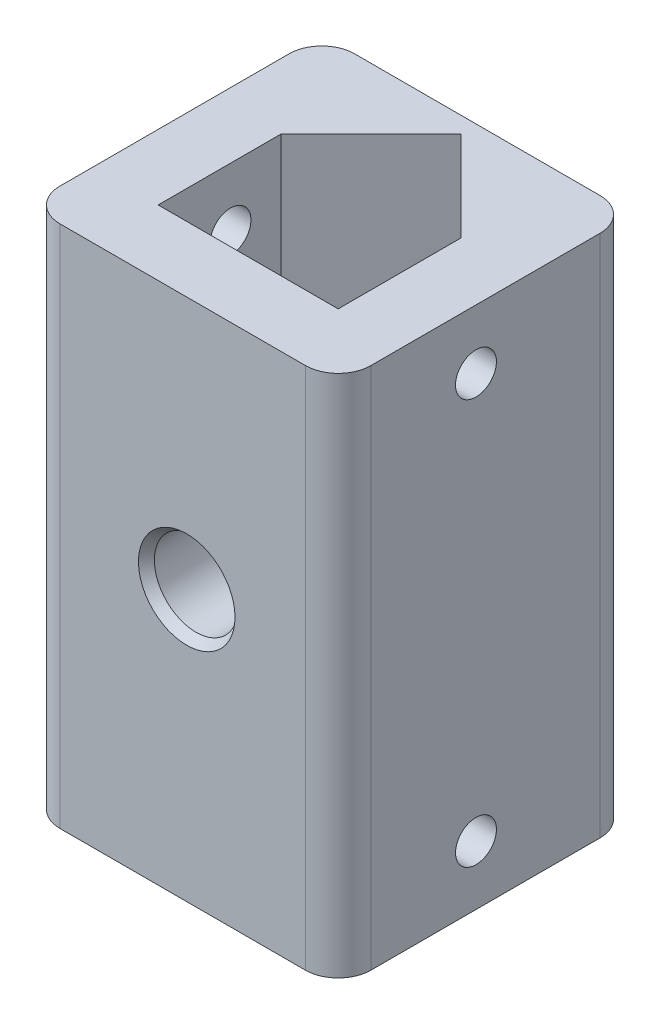
ISO-10303-21;
HEADER;
FILE_DESCRIPTION(('STEP AP214'),'2;1');
FILE_NAME('part.step','',(''),(''),'','','');
FILE_SCHEMA(('AUTOMOTIVE_DESIGN { 1 0 10303 214 1 1 1 1 }'));
ENDSEC;
DATA;
#1=APPLICATION_CONTEXT('core data for automotive mechanical design processes');
#2=APPLICATION_PROTOCOL_DEFINITION('international standard','automotive_design',2000,#1);
#3=PRODUCT_CONTEXT('',#1,'mechanical');
#4=PRODUCT('Part','Part','',(#3));
#5=PRODUCT_RELATED_PRODUCT_CATEGORY('part','',(#4));
#6=PRODUCT_DEFINITION_FORMATION('','',#4);
#7=PRODUCT_DEFINITION_CONTEXT('part definition',#1,'design');
#8=PRODUCT_DEFINITION('design','',#6,#7);
#9=PRODUCT_DEFINITION_SHAPE('','',#8);
#10=(LENGTH_UNIT() NAMED_UNIT(*) SI_UNIT(.MILLI.,.METRE.));
#11=(NAMED_UNIT(*) PLANE_ANGLE_UNIT() SI_UNIT($,.RADIAN.));
#12=(NAMED_UNIT(*) SI_UNIT($,.STERADIAN.) SOLID_ANGLE_UNIT());
#13=UNCERTAINTY_MEASURE_WITH_UNIT(LENGTH_MEASURE(1.E-05),#10,'distance_accuracy_value','');
#14=(GEOMETRIC_REPRESENTATION_CONTEXT(3) GLOBAL_UNCERTAINTY_ASSIGNED_CONTEXT((#13)) GLOBAL_UNIT_ASSIGNED_CONTEXT((#10,
#11,#12)) REPRESENTATION_CONTEXT('',''));
#15=CARTESIAN_POINT('',(0.,0.,0.));
#16=DIRECTION('',(0.,0.,1.));
#17=DIRECTION('',(1.,0.,0.));
#18=AXIS2_PLACEMENT_3D('',#15,#16,#17);
#19=CARTESIAN_POINT('',(0.,32.,0.));
#20=DIRECTION('',(0.,-1.,0.));
#21=DIRECTION('',(0.,0.,-1.));
#22=AXIS2_PLACEMENT_3D('',#19,#20,#21);
#23=PLANE('',#22);
#24=DIRECTION('',(0.,0.,-1.));
#25=VECTOR('',#24,1.);
#26=CARTESIAN_POINT('',(19.,32.,0.));
#27=LINE('',#26,#25);
#28=CARTESIAN_POINT('',(19.,32.,-2.));
#29=VERTEX_POINT('',#28);
#30=CARTESIAN_POINT('',(19.,32.,-16.));
#31=VERTEX_POINT('',#30);
#32=EDGE_CURVE('E231',#29,#31,#27,.T.);
#33=ORIENTED_EDGE('',*,*,#32,.T.);
#34=CARTESIAN_POINT('',(17.,32.,-16.));
#35=DIRECTION('',(0.,-1.,0.));
#36=DIRECTION('',(0.,0.,-1.));
#37=AXIS2_PLACEMENT_3D('',#34,#35,#36);
#38=CIRCLE('',#37,2.);
#39=CARTESIAN_POINT('',(17.,32.,-18.));
#40=VERTEX_POINT('',#39);
#41=EDGE_CURVE('E295',#31,#40,#38,.F.);
#42=ORIENTED_EDGE('',*,*,#41,.T.);
#43=DIRECTION('',(-1.,0.,0.));
#44=VECTOR('',#43,1.);
#45=CARTESIAN_POINT('',(0.,32.,-18.));
#46=LINE('',#45,#44);
#47=CARTESIAN_POINT('',(2.,32.,-18.));
#48=VERTEX_POINT('',#47);
#49=EDGE_CURVE('E235',#40,#48,#46,.T.);
#50=ORIENTED_EDGE('',*,*,#49,.T.);
#51=CARTESIAN_POINT('',(2.,32.,-16.));
#52=DIRECTION('',(0.,-1.,0.));
#53=DIRECTION('',(0.,0.,-1.));
#54=AXIS2_PLACEMENT_3D('',#51,#52,#53);
#55=CIRCLE('',#54,2.);
#56=CARTESIAN_POINT('',(0.,32.,-16.));
#57=VERTEX_POINT('',#56);
#58=EDGE_CURVE('E289',#48,#57,#55,.F.);
#59=ORIENTED_EDGE('',*,*,#58,.T.);
#60=DIRECTION('',(0.,0.,1.));
#61=VECTOR('',#60,1.);
#62=CARTESIAN_POINT('',(0.,32.,0.));
#63=LINE('',#62,#61);
#64=CARTESIAN_POINT('',(0.,32.,-2.));
#65=VERTEX_POINT('',#64);
#66=EDGE_CURVE('E225',#57,#65,#63,.T.);
#67=ORIENTED_EDGE('',*,*,#66,.T.);
#68=CARTESIAN_POINT('',(2.,32.,-2.));
#69=DIRECTION('',(0.,-1.,0.));
#70=DIRECTION('',(0.,0.,-1.));
#71=AXIS2_PLACEMENT_3D('',#68,#69,#70);
#72=CIRCLE('',#71,2.);
#73=CARTESIAN_POINT('',(2.,32.,0.));
#74=VERTEX_POINT('',#73);
#75=EDGE_CURVE('E67',#65,#74,#72,.F.);
#76=ORIENTED_EDGE('',*,*,#75,.T.);
#77=DIRECTION('',(1.,0.,0.));
#78=VECTOR('',#77,1.);
#79=CARTESIAN_POINT('',(0.,32.,0.));
#80=LINE('',#79,#78);
#81=CARTESIAN_POINT('',(17.,32.,0.));
#82=VERTEX_POINT('',#81);
#83=EDGE_CURVE('E227',#74,#82,#80,.T.);
#84=ORIENTED_EDGE('',*,*,#83,.T.);
#85=CARTESIAN_POINT('',(17.,32.,-2.));
#86=DIRECTION('',(0.,-1.,0.));
#87=DIRECTION('',(0.,0.,-1.));
#88=AXIS2_PLACEMENT_3D('',#85,#86,#87);
#89=CIRCLE('',#88,2.);
#90=EDGE_CURVE('E292',#82,#29,#89,.F.);
#91=ORIENTED_EDGE('',*,*,#90,.T.);
#92=EDGE_LOOP('',(#33,#42,#50,#59,#67,#76,#84,#91));
#93=FACE_BOUND('',#92,.T.);
#94=DIRECTION('',(0.,0.,1.));
#95=VECTOR('',#94,1.);
#96=CARTESIAN_POINT('',(4.,32.,-11.5));
#97=LINE('',#96,#95);
#98=CARTESIAN_POINT('',(4.,32.,-11.5));
#99=VERTEX_POINT('',#98);
#100=CARTESIAN_POINT('',(4.,32.,-4.));
#101=VERTEX_POINT('',#100);
#102=EDGE_CURVE('E159',#99,#101,#97,.T.);
#103=ORIENTED_EDGE('',*,*,#102,.F.);
#104=DIRECTION('',(-0.707106781186546,0.,0.707106781186549));
#105=VECTOR('',#104,1.);
#106=CARTESIAN_POINT('',(9.5,32.,-17.));
#107=LINE('',#106,#105);
#108=CARTESIAN_POINT('',(9.5,32.,-17.));
#109=VERTEX_POINT('',#108);
#110=EDGE_CURVE('E196',#109,#99,#107,.T.);
#111=ORIENTED_EDGE('',*,*,#110,.F.);
#112=DIRECTION('',(-0.707106781186546,0.,-0.707106781186549));
#113=VECTOR('',#112,1.);
#114=CARTESIAN_POINT('',(15.,32.,-11.5));
#115=LINE('',#114,#113);
#116=CARTESIAN_POINT('',(15.,32.,-11.5));
#117=VERTEX_POINT('',#116);
#118=EDGE_CURVE('E189',#117,#109,#115,.T.);
#119=ORIENTED_EDGE('',*,*,#118,.F.);
#120=DIRECTION('',(0.,0.,-1.));
#121=VECTOR('',#120,1.);
#122=CARTESIAN_POINT('',(15.,32.,-4.));
#123=LINE('',#122,#121);
#124=CARTESIAN_POINT('',(15.,32.,-4.));
#125=VERTEX_POINT('',#124);
#126=EDGE_CURVE('E184',#125,#117,#123,.T.);
#127=ORIENTED_EDGE('',*,*,#126,.F.);
#128=DIRECTION('',(1.,0.,0.));
#129=VECTOR('',#128,1.);
#130=CARTESIAN_POINT('',(4.,32.,-4.));
#131=LINE('',#130,#129);
#132=EDGE_CURVE('E170',#101,#125,#131,.T.);
#133=ORIENTED_EDGE('',*,*,#132,.F.);
#134=EDGE_LOOP('',(#103,#111,#119,#127,#133));
#135=FACE_BOUND('',#134,.T.);
#136=ADVANCED_FACE('F38',(#93,#135),#23,.F.);
#137=CARTESIAN_POINT('',(0.,0.,0.));
#138=DIRECTION('',(0.,-1.,0.));
#139=DIRECTION('',(0.,0.,-1.));
#140=AXIS2_PLACEMENT_3D('',#137,#138,#139);
#141=PLANE('',#140);
#142=DIRECTION('',(-1.,0.,0.));
#143=VECTOR('',#142,1.);
#144=CARTESIAN_POINT('',(0.,0.,-18.));
#145=LINE('',#144,#143);
#146=CARTESIAN_POINT('',(17.,0.,-18.));
#147=VERTEX_POINT('',#146);
#148=CARTESIAN_POINT('',(2.,0.,-18.));
#149=VERTEX_POINT('',#148);
#150=EDGE_CURVE('E228',#147,#149,#145,.T.);
#151=ORIENTED_EDGE('',*,*,#150,.F.);
#152=CARTESIAN_POINT('',(17.,0.,-16.));
#153=DIRECTION('',(0.,-1.,0.));
#154=DIRECTION('',(0.,0.,-1.));
#155=AXIS2_PLACEMENT_3D('',#152,#153,#154);
#156=CIRCLE('',#155,2.);
#157=CARTESIAN_POINT('',(19.,0.,-16.));
#158=VERTEX_POINT('',#157);
#159=EDGE_CURVE('E277',#147,#158,#156,.T.);
#160=ORIENTED_EDGE('',*,*,#159,.T.);
#161=DIRECTION('',(0.,0.,-1.));
#162=VECTOR('',#161,1.);
#163=CARTESIAN_POINT('',(19.,0.,0.));
#164=LINE('',#163,#162);
#165=CARTESIAN_POINT('',(19.,0.,-2.));
#166=VERTEX_POINT('',#165);
#167=EDGE_CURVE('E246',#166,#158,#164,.T.);
#168=ORIENTED_EDGE('',*,*,#167,.F.);
#169=CARTESIAN_POINT('',(17.,0.,-2.));
#170=DIRECTION('',(0.,-1.,0.));
#171=DIRECTION('',(0.,0.,-1.));
#172=AXIS2_PLACEMENT_3D('',#169,#170,#171);
#173=CIRCLE('',#172,2.);
#174=CARTESIAN_POINT('',(17.,0.,0.));
#175=VERTEX_POINT('',#174);
#176=EDGE_CURVE('E275',#166,#175,#173,.T.);
#177=ORIENTED_EDGE('',*,*,#176,.T.);
#178=DIRECTION('',(1.,0.,0.));
#179=VECTOR('',#178,1.);
#180=CARTESIAN_POINT('',(0.,0.,0.));
#181=LINE('',#180,#179);
#182=CARTESIAN_POINT('',(2.,0.,0.));
#183=VERTEX_POINT('',#182);
#184=EDGE_CURVE('E243',#183,#175,#181,.T.);
#185=ORIENTED_EDGE('',*,*,#184,.F.);
#186=CARTESIAN_POINT('',(2.,0.,-2.));
#187=DIRECTION('',(0.,-1.,0.));
#188=DIRECTION('',(0.,0.,-1.));
#189=AXIS2_PLACEMENT_3D('',#186,#187,#188);
#190=CIRCLE('',#189,2.);
#191=CARTESIAN_POINT('',(0.,0.,-2.));
#192=VERTEX_POINT('',#191);
#193=EDGE_CURVE('E269',#183,#192,#190,.T.);
#194=ORIENTED_EDGE('',*,*,#193,.T.);
#195=DIRECTION('',(0.,0.,1.));
#196=VECTOR('',#195,1.);
#197=CARTESIAN_POINT('',(0.,0.,0.));
#198=LINE('',#197,#196);
#199=CARTESIAN_POINT('',(0.,0.,-16.));
#200=VERTEX_POINT('',#199);
#201=EDGE_CURVE('E179',#200,#192,#198,.T.);
#202=ORIENTED_EDGE('',*,*,#201,.F.);
#203=CARTESIAN_POINT('',(2.,0.,-16.));
#204=DIRECTION('',(0.,-1.,0.));
#205=DIRECTION('',(0.,0.,-1.));
#206=AXIS2_PLACEMENT_3D('',#203,#204,#205);
#207=CIRCLE('',#206,2.);
#208=EDGE_CURVE('E272',#200,#149,#207,.T.);
#209=ORIENTED_EDGE('',*,*,#208,.T.);
#210=EDGE_LOOP('',(#151,#160,#168,#177,#185,#194,#202,#209));
#211=FACE_BOUND('',#210,.T.);
#212=DIRECTION('',(-0.707106781186546,0.,0.707106781186549));
#213=VECTOR('',#212,1.);
#214=CARTESIAN_POINT('',(9.5,0.,-17.));
#215=LINE('',#214,#213);
#216=CARTESIAN_POINT('',(9.5,0.,-17.));
#217=VERTEX_POINT('',#216);
#218=CARTESIAN_POINT('',(4.,0.,-11.5));
#219=VERTEX_POINT('',#218);
#220=EDGE_CURVE('E171',#217,#219,#215,.T.);
#221=ORIENTED_EDGE('',*,*,#220,.T.);
#222=DIRECTION('',(0.,0.,1.));
#223=VECTOR('',#222,1.);
#224=CARTESIAN_POINT('',(4.,0.,-11.5));
#225=LINE('',#224,#223);
#226=CARTESIAN_POINT('',(4.,0.,-4.));
#227=VERTEX_POINT('',#226);
#228=EDGE_CURVE('E199',#219,#227,#225,.T.);
#229=ORIENTED_EDGE('',*,*,#228,.T.);
#230=DIRECTION('',(1.,0.,0.));
#231=VECTOR('',#230,1.);
#232=CARTESIAN_POINT('',(4.,0.,-4.));
#233=LINE('',#232,#231);
#234=CARTESIAN_POINT('',(15.,0.,-4.));
#235=VERTEX_POINT('',#234);
#236=EDGE_CURVE('E177',#227,#235,#233,.T.);
#237=ORIENTED_EDGE('',*,*,#236,.T.);
#238=DIRECTION('',(0.,0.,-1.));
#239=VECTOR('',#238,1.);
#240=CARTESIAN_POINT('',(15.,0.,-4.));
#241=LINE('',#240,#239);
#242=CARTESIAN_POINT('',(15.,0.,-11.5));
#243=VERTEX_POINT('',#242);
#244=EDGE_CURVE('E205',#235,#243,#241,.T.);
#245=ORIENTED_EDGE('',*,*,#244,.T.);
#246=DIRECTION('',(-0.707106781186546,0.,-0.707106781186549));
#247=VECTOR('',#246,1.);
#248=CARTESIAN_POINT('',(15.,0.,-11.5));
#249=LINE('',#248,#247);
#250=EDGE_CURVE('E208',#243,#217,#249,.T.);
#251=ORIENTED_EDGE('',*,*,#250,.T.);
#252=EDGE_LOOP('',(#221,#229,#237,#245,#251));
#253=FACE_BOUND('',#252,.T.);
#254=ADVANCED_FACE('F317',(#211,#253),#141,.T.);
#255=CARTESIAN_POINT('',(0.,32.,0.));
#256=DIRECTION('',(1.,0.,0.));
#257=DIRECTION('',(0.,0.,-1.));
#258=AXIS2_PLACEMENT_3D('',#255,#256,#257);
#259=PLANE('',#258);
#260=CARTESIAN_POINT('',(0.,28.3749999996663,-8.41922621917511));
#261=DIRECTION('',(1.,0.,0.));
#262=DIRECTION('',(0.,0.,-1.));
#263=AXIS2_PLACEMENT_3D('',#260,#261,#262);
#264=CIRCLE('',#263,1.24999999999999);
#265=CARTESIAN_POINT('',(0.,28.3749999996663,-9.6692262191751));
#266=VERTEX_POINT('',#265);
#267=EDGE_CURVE('E262',#266,#266,#264,.T.);
#268=ORIENTED_EDGE('',*,*,#267,.T.);
#269=EDGE_LOOP('',(#268));
#270=FACE_BOUND('',#269,.T.);
#271=CARTESIAN_POINT('',(0.,3.62499999999998,-8.41922621917511));
#272=DIRECTION('',(1.,0.,0.));
#273=DIRECTION('',(0.,0.,-1.));
#274=AXIS2_PLACEMENT_3D('',#271,#272,#273);
#275=CIRCLE('',#274,1.25);
#276=CARTESIAN_POINT('',(0.,3.62499999999998,-9.66922621917511));
#277=VERTEX_POINT('',#276);
#278=EDGE_CURVE('E256',#277,#277,#275,.T.);
#279=ORIENTED_EDGE('',*,*,#278,.T.);
#280=EDGE_LOOP('',(#279));
#281=FACE_BOUND('',#280,.T.);
#282=ORIENTED_EDGE('',*,*,#66,.F.);
#283=DIRECTION('',(0.,-1.,0.));
#284=VECTOR('',#283,1.);
#285=CARTESIAN_POINT('',(0.,32.,-16.));
#286=LINE('',#285,#284);
#287=EDGE_CURVE('E11',#57,#200,#286,.T.);
#288=ORIENTED_EDGE('',*,*,#287,.T.);
#289=ORIENTED_EDGE('',*,*,#201,.T.);
#290=DIRECTION('',(0.,-1.,0.));
#291=VECTOR('',#290,1.);
#292=CARTESIAN_POINT('',(0.,32.,-2.));
#293=LINE('',#292,#291);
#294=EDGE_CURVE('E47',#192,#65,#293,.F.);
#295=ORIENTED_EDGE('',*,*,#294,.T.);
#296=EDGE_LOOP('',(#282,#288,#289,#295));
#297=FACE_BOUND('',#296,.T.);
#298=ADVANCED_FACE('F307',(#270,#281,#297),#259,.F.);
#299=CARTESIAN_POINT('',(0.,32.,0.));
#300=DIRECTION('',(0.,0.,-1.));
#301=DIRECTION('',(-1.,0.,0.));
#302=AXIS2_PLACEMENT_3D('',#299,#300,#301);
#303=PLANE('',#302);
#304=CARTESIAN_POINT('',(9.74439764527801,16.5210513003871,0.));
#305=DIRECTION('',(0.,0.,1.));
#306=DIRECTION('',(1.,0.,0.));
#307=AXIS2_PLACEMENT_3D('',#304,#305,#306);
#308=CIRCLE('',#307,2.95);
#309=CARTESIAN_POINT('',(12.694397645278,16.5210513003871,0.));
#310=VERTEX_POINT('',#309);
#311=EDGE_CURVE('E417',#310,#310,#308,.T.);
#312=ORIENTED_EDGE('',*,*,#311,.F.);
#313=EDGE_LOOP('',(#312));
#314=FACE_BOUND('',#313,.T.);
#315=ORIENTED_EDGE('',*,*,#184,.T.);
#316=DIRECTION('',(0.,-1.,0.));
#317=VECTOR('',#316,1.);
#318=CARTESIAN_POINT('',(17.,32.,0.));
#319=LINE('',#318,#317);
#320=EDGE_CURVE('E57',#175,#82,#319,.F.);
#321=ORIENTED_EDGE('',*,*,#320,.T.);
#322=ORIENTED_EDGE('',*,*,#83,.F.);
#323=DIRECTION('',(0.,-1.,0.));
#324=VECTOR('',#323,1.);
#325=CARTESIAN_POINT('',(2.,32.,0.));
#326=LINE('',#325,#324);
#327=EDGE_CURVE('E298',#74,#183,#326,.T.);
#328=ORIENTED_EDGE('',*,*,#327,.T.);
#329=EDGE_LOOP('',(#315,#321,#322,#328));
#330=FACE_BOUND('',#329,.T.);
#331=ADVANCED_FACE('F314',(#314,#330),#303,.F.);
#332=CARTESIAN_POINT('',(19.,32.,0.));
#333=DIRECTION('',(-1.,0.,0.));
#334=DIRECTION('',(0.,0.,1.));
#335=AXIS2_PLACEMENT_3D('',#332,#333,#334);
#336=PLANE('',#335);
#337=CARTESIAN_POINT('',(19.,28.3749999996663,-8.41922621917511));
#338=DIRECTION('',(1.,0.,0.));
#339=DIRECTION('',(0.,0.,-1.));
#340=AXIS2_PLACEMENT_3D('',#337,#338,#339);
#341=CIRCLE('',#340,1.25);
#342=CARTESIAN_POINT('',(19.,28.3749999996663,-9.66922621917511));
#343=VERTEX_POINT('',#342);
#344=EDGE_CURVE('E409',#343,#343,#341,.T.);
#345=ORIENTED_EDGE('',*,*,#344,.F.);
#346=EDGE_LOOP('',(#345));
#347=FACE_BOUND('',#346,.T.);
#348=CARTESIAN_POINT('',(19.,3.62499999999998,-8.41922621917511));
#349=DIRECTION('',(1.,0.,0.));
#350=DIRECTION('',(0.,0.,-1.));
#351=AXIS2_PLACEMENT_3D('',#348,#349,#350);
#352=CIRCLE('',#351,1.25);
#353=CARTESIAN_POINT('',(19.,3.62499999999998,-9.66922621917511));
#354=VERTEX_POINT('',#353);
#355=EDGE_CURVE('E426',#354,#354,#352,.T.);
#356=ORIENTED_EDGE('',*,*,#355,.F.);
#357=EDGE_LOOP('',(#356));
#358=FACE_BOUND('',#357,.T.);
#359=ORIENTED_EDGE('',*,*,#167,.T.);
#360=DIRECTION('',(0.,-1.,0.));
#361=VECTOR('',#360,1.);
#362=CARTESIAN_POINT('',(19.,32.,-16.));
#363=LINE('',#362,#361);
#364=EDGE_CURVE('E284',#158,#31,#363,.F.);
#365=ORIENTED_EDGE('',*,*,#364,.T.);
#366=ORIENTED_EDGE('',*,*,#32,.F.);
#367=DIRECTION('',(0.,-1.,0.));
#368=VECTOR('',#367,1.);
#369=CARTESIAN_POINT('',(19.,32.,-2.));
#370=LINE('',#369,#368);
#371=EDGE_CURVE('E280',#29,#166,#370,.T.);
#372=ORIENTED_EDGE('',*,*,#371,.T.);
#373=EDGE_LOOP('',(#359,#365,#366,#372));
#374=FACE_BOUND('',#373,.T.);
#375=ADVANCED_FACE('F326',(#347,#358,#374),#336,.F.);
#376=CARTESIAN_POINT('',(0.,32.,-18.));
#377=DIRECTION('',(0.,0.,1.));
#378=DIRECTION('',(1.,0.,0.));
#379=AXIS2_PLACEMENT_3D('',#376,#377,#378);
#380=PLANE('',#379);
#381=ORIENTED_EDGE('',*,*,#49,.F.);
#382=DIRECTION('',(0.,-1.,0.));
#383=VECTOR('',#382,1.);
#384=CARTESIAN_POINT('',(17.,32.,-18.));
#385=LINE('',#384,#383);
#386=EDGE_CURVE('E265',#40,#147,#385,.T.);
#387=ORIENTED_EDGE('',*,*,#386,.T.);
#388=ORIENTED_EDGE('',*,*,#150,.T.);
#389=DIRECTION('',(0.,-1.,0.));
#390=VECTOR('',#389,1.);
#391=CARTESIAN_POINT('',(2.,32.,-18.));
#392=LINE('',#391,#390);
#393=EDGE_CURVE('E239',#149,#48,#392,.F.);
#394=ORIENTED_EDGE('',*,*,#393,.T.);
#395=EDGE_LOOP('',(#381,#387,#388,#394));
#396=FACE_BOUND('',#395,.T.);
#397=ADVANCED_FACE('F334',(#396),#380,.F.);
#398=CARTESIAN_POINT('',(4.,32.,-11.5));
#399=DIRECTION('',(1.,0.,0.));
#400=DIRECTION('',(0.,0.,-1.));
#401=AXIS2_PLACEMENT_3D('',#398,#399,#400);
#402=PLANE('',#401);
#403=CARTESIAN_POINT('',(4.,28.3749999996663,-8.41922621917511));
#404=DIRECTION('',(1.,0.,0.));
#405=DIRECTION('',(0.,0.,-1.));
#406=AXIS2_PLACEMENT_3D('',#403,#404,#405);
#407=CIRCLE('',#406,1.25);
#408=CARTESIAN_POINT('',(4.,28.3749999996663,-9.66922621917511));
#409=VERTEX_POINT('',#408);
#410=EDGE_CURVE('E261',#409,#409,#407,.T.);
#411=ORIENTED_EDGE('',*,*,#410,.F.);
#412=EDGE_LOOP('',(#411));
#413=FACE_BOUND('',#412,.T.);
#414=CARTESIAN_POINT('',(4.,3.62499999999998,-8.41922621917511));
#415=DIRECTION('',(1.,0.,0.));
#416=DIRECTION('',(0.,0.,-1.));
#417=AXIS2_PLACEMENT_3D('',#414,#415,#416);
#418=CIRCLE('',#417,1.25);
#419=CARTESIAN_POINT('',(4.,3.62499999999998,-9.66922621917511));
#420=VERTEX_POINT('',#419);
#421=EDGE_CURVE('E202',#420,#420,#418,.T.);
#422=ORIENTED_EDGE('',*,*,#421,.F.);
#423=EDGE_LOOP('',(#422));
#424=FACE_BOUND('',#423,.T.);
#425=ORIENTED_EDGE('',*,*,#228,.F.);
#426=DIRECTION('',(0.,-1.,0.));
#427=VECTOR('',#426,1.);
#428=CARTESIAN_POINT('',(4.,32.,-11.5));
#429=LINE('',#428,#427);
#430=EDGE_CURVE('E165',#99,#219,#429,.T.);
#431=ORIENTED_EDGE('',*,*,#430,.F.);
#432=ORIENTED_EDGE('',*,*,#102,.T.);
#433=DIRECTION('',(0.,-1.,0.));
#434=VECTOR('',#433,1.);
#435=CARTESIAN_POINT('',(4.,32.,-4.));
#436=LINE('',#435,#434);
#437=EDGE_CURVE('E162',#101,#227,#436,.T.);
#438=ORIENTED_EDGE('',*,*,#437,.T.);
#439=EDGE_LOOP('',(#425,#431,#432,#438));
#440=FACE_BOUND('',#439,.T.);
#441=ADVANCED_FACE('F161',(#413,#424,#440),#402,.T.);
#442=CARTESIAN_POINT('',(4.,32.,-4.));
#443=DIRECTION('',(0.,0.,-1.));
#444=DIRECTION('',(-1.,0.,0.));
#445=AXIS2_PLACEMENT_3D('',#442,#443,#444);
#446=PLANE('',#445);
#447=CARTESIAN_POINT('',(9.74439764527801,16.5210513003871,-4.));
#448=DIRECTION('',(0.,0.,-1.));
#449=DIRECTION('',(-1.,0.,0.));
#450=AXIS2_PLACEMENT_3D('',#447,#448,#449);
#451=CIRCLE('',#450,2.55);
#452=CARTESIAN_POINT('',(7.19439764527802,16.5210513003871,-4.));
#453=VERTEX_POINT('',#452);
#454=EDGE_CURVE('E406',#453,#453,#451,.T.);
#455=ORIENTED_EDGE('',*,*,#454,.F.);
#456=EDGE_LOOP('',(#455));
#457=FACE_BOUND('',#456,.T.);
#458=ORIENTED_EDGE('',*,*,#236,.F.);
#459=ORIENTED_EDGE('',*,*,#437,.F.);
#460=ORIENTED_EDGE('',*,*,#132,.T.);
#461=DIRECTION('',(0.,-1.,0.));
#462=VECTOR('',#461,1.);
#463=CARTESIAN_POINT('',(15.,32.,-4.));
#464=LINE('',#463,#462);
#465=EDGE_CURVE('E180',#125,#235,#464,.T.);
#466=ORIENTED_EDGE('',*,*,#465,.T.);
#467=EDGE_LOOP('',(#458,#459,#460,#466));
#468=FACE_BOUND('',#467,.T.);
#469=ADVANCED_FACE('F174',(#457,#468),#446,.T.);
#470=CARTESIAN_POINT('',(15.,32.,-4.));
#471=DIRECTION('',(-1.,0.,0.));
#472=DIRECTION('',(0.,0.,1.));
#473=AXIS2_PLACEMENT_3D('',#470,#471,#472);
#474=PLANE('',#473);
#475=CARTESIAN_POINT('',(15.,28.3749999996663,-8.41922621917511));
#476=DIRECTION('',(-1.,0.,0.));
#477=DIRECTION('',(0.,0.,1.));
#478=AXIS2_PLACEMENT_3D('',#475,#476,#477);
#479=CIRCLE('',#478,1.25);
#480=CARTESIAN_POINT('',(15.,28.3749999996663,-7.16922621917511));
#481=VERTEX_POINT('',#480);
#482=EDGE_CURVE('E257',#481,#481,#479,.T.);
#483=ORIENTED_EDGE('',*,*,#482,.F.);
#484=EDGE_LOOP('',(#483));
#485=FACE_BOUND('',#484,.T.);
#486=CARTESIAN_POINT('',(15.,3.62499999999998,-8.41922621917511));
#487=DIRECTION('',(-1.,0.,0.));
#488=DIRECTION('',(0.,0.,1.));
#489=AXIS2_PLACEMENT_3D('',#486,#487,#488);
#490=CIRCLE('',#489,1.25);
#491=CARTESIAN_POINT('',(15.,3.62499999999998,-7.16922621917512));
#492=VERTEX_POINT('',#491);
#493=EDGE_CURVE('E253',#492,#492,#490,.T.);
#494=ORIENTED_EDGE('',*,*,#493,.F.);
#495=EDGE_LOOP('',(#494));
#496=FACE_BOUND('',#495,.T.);
#497=ORIENTED_EDGE('',*,*,#244,.F.);
#498=ORIENTED_EDGE('',*,*,#465,.F.);
#499=ORIENTED_EDGE('',*,*,#126,.T.);
#500=DIRECTION('',(0.,-1.,0.));
#501=VECTOR('',#500,1.);
#502=CARTESIAN_POINT('',(15.,32.,-11.5));
#503=LINE('',#502,#501);
#504=EDGE_CURVE('E220',#117,#243,#503,.T.);
#505=ORIENTED_EDGE('',*,*,#504,.T.);
#506=EDGE_LOOP('',(#497,#498,#499,#505));
#507=FACE_BOUND('',#506,.T.);
#508=ADVANCED_FACE('F394',(#485,#496,#507),#474,.T.);
#509=CARTESIAN_POINT('',(15.,32.,-11.5));
#510=DIRECTION('',(-0.707106781186549,0.,0.707106781186546));
#511=DIRECTION('',(0.707106781186546,0.,0.707106781186549));
#512=AXIS2_PLACEMENT_3D('',#509,#510,#511);
#513=PLANE('',#512);
#514=ORIENTED_EDGE('',*,*,#250,.F.);
#515=ORIENTED_EDGE('',*,*,#504,.F.);
#516=ORIENTED_EDGE('',*,*,#118,.T.);
#517=DIRECTION('',(0.,-1.,0.));
#518=VECTOR('',#517,1.);
#519=CARTESIAN_POINT('',(9.5,32.,-17.));
#520=LINE('',#519,#518);
#521=EDGE_CURVE('E217',#109,#217,#520,.T.);
#522=ORIENTED_EDGE('',*,*,#521,.T.);
#523=EDGE_LOOP('',(#514,#515,#516,#522));
#524=FACE_BOUND('',#523,.T.);
#525=ADVANCED_FACE('F390',(#524),#513,.T.);
#526=CARTESIAN_POINT('',(9.5,32.,-17.));
#527=DIRECTION('',(0.707106781186549,0.,0.707106781186546));
#528=DIRECTION('',(0.707106781186546,0.,-0.707106781186549));
#529=AXIS2_PLACEMENT_3D('',#526,#527,#528);
#530=PLANE('',#529);
#531=ORIENTED_EDGE('',*,*,#220,.F.);
#532=ORIENTED_EDGE('',*,*,#521,.F.);
#533=ORIENTED_EDGE('',*,*,#110,.T.);
#534=ORIENTED_EDGE('',*,*,#430,.T.);
#535=EDGE_LOOP('',(#531,#532,#533,#534));
#536=FACE_BOUND('',#535,.T.);
#537=ADVANCED_FACE('F386',(#536),#530,.T.);
#538=CARTESIAN_POINT('',(19.,3.62499999999998,-8.41922621917511));
#539=DIRECTION('',(1.,0.,0.));
#540=DIRECTION('',(0.,0.,-1.));
#541=AXIS2_PLACEMENT_3D('',#538,#539,#540);
#542=CYLINDRICAL_SURFACE('',#541,1.25);
#543=ORIENTED_EDGE('',*,*,#493,.T.);
#544=EDGE_LOOP('',(#543));
#545=FACE_BOUND('',#544,.T.);
#546=ORIENTED_EDGE('',*,*,#355,.T.);
#547=EDGE_LOOP('',(#546));
#548=FACE_BOUND('',#547,.T.);
#549=ADVANCED_FACE('F383',(#545,#548),#542,.F.);
#550=ORIENTED_EDGE('',*,*,#421,.T.);
#551=EDGE_LOOP('',(#550));
#552=FACE_BOUND('',#551,.T.);
#553=ORIENTED_EDGE('',*,*,#278,.F.);
#554=EDGE_LOOP('',(#553));
#555=FACE_BOUND('',#554,.T.);
#556=ADVANCED_FACE('F376',(#552,#555),#542,.F.);
#557=CARTESIAN_POINT('',(19.,28.3749999996663,-8.41922621917511));
#558=DIRECTION('',(1.,0.,0.));
#559=DIRECTION('',(0.,0.,-1.));
#560=AXIS2_PLACEMENT_3D('',#557,#558,#559);
#561=CYLINDRICAL_SURFACE('',#560,1.25);
#562=ORIENTED_EDGE('',*,*,#482,.T.);
#563=EDGE_LOOP('',(#562));
#564=FACE_BOUND('',#563,.T.);
#565=ORIENTED_EDGE('',*,*,#344,.T.);
#566=EDGE_LOOP('',(#565));
#567=FACE_BOUND('',#566,.T.);
#568=ADVANCED_FACE('F370',(#564,#567),#561,.F.);
#569=ORIENTED_EDGE('',*,*,#410,.T.);
#570=EDGE_LOOP('',(#569));
#571=FACE_BOUND('',#570,.T.);
#572=ORIENTED_EDGE('',*,*,#267,.F.);
#573=EDGE_LOOP('',(#572));
#574=FACE_BOUND('',#573,.T.);
#575=ADVANCED_FACE('F366',(#571,#574),#561,.F.);
#576=CARTESIAN_POINT('',(17.,32.,-16.));
#577=DIRECTION('',(0.,-1.,0.));
#578=DIRECTION('',(0.,0.,-1.));
#579=AXIS2_PLACEMENT_3D('',#576,#577,#578);
#580=CYLINDRICAL_SURFACE('',#579,2.);
#581=ORIENTED_EDGE('',*,*,#41,.F.);
#582=ORIENTED_EDGE('',*,*,#364,.F.);
#583=ORIENTED_EDGE('',*,*,#159,.F.);
#584=ORIENTED_EDGE('',*,*,#386,.F.);
#585=EDGE_LOOP('',(#581,#582,#583,#584));
#586=FACE_BOUND('',#585,.T.);
#587=ADVANCED_FACE('F332',(#586),#580,.T.);
#588=CARTESIAN_POINT('',(17.,32.,-2.));
#589=DIRECTION('',(0.,-1.,0.));
#590=DIRECTION('',(0.,0.,-1.));
#591=AXIS2_PLACEMENT_3D('',#588,#589,#590);
#592=CYLINDRICAL_SURFACE('',#591,2.);
#593=ORIENTED_EDGE('',*,*,#90,.F.);
#594=ORIENTED_EDGE('',*,*,#320,.F.);
#595=ORIENTED_EDGE('',*,*,#176,.F.);
#596=ORIENTED_EDGE('',*,*,#371,.F.);
#597=EDGE_LOOP('',(#593,#594,#595,#596));
#598=FACE_BOUND('',#597,.T.);
#599=ADVANCED_FACE('F323',(#598),#592,.T.);
#600=CARTESIAN_POINT('',(2.,32.,-16.));
#601=DIRECTION('',(0.,-1.,0.));
#602=DIRECTION('',(0.,0.,-1.));
#603=AXIS2_PLACEMENT_3D('',#600,#601,#602);
#604=CYLINDRICAL_SURFACE('',#603,2.);
#605=ORIENTED_EDGE('',*,*,#58,.F.);
#606=ORIENTED_EDGE('',*,*,#393,.F.);
#607=ORIENTED_EDGE('',*,*,#208,.F.);
#608=ORIENTED_EDGE('',*,*,#287,.F.);
#609=EDGE_LOOP('',(#605,#606,#607,#608));
#610=FACE_BOUND('',#609,.T.);
#611=ADVANCED_FACE('F337',(#610),#604,.T.);
#612=CARTESIAN_POINT('',(2.,32.,-2.));
#613=DIRECTION('',(0.,-1.,0.));
#614=DIRECTION('',(0.,0.,-1.));
#615=AXIS2_PLACEMENT_3D('',#612,#613,#614);
#616=CYLINDRICAL_SURFACE('',#615,2.);
#617=ORIENTED_EDGE('',*,*,#75,.F.);
#618=ORIENTED_EDGE('',*,*,#294,.F.);
#619=ORIENTED_EDGE('',*,*,#193,.F.);
#620=ORIENTED_EDGE('',*,*,#327,.F.);
#621=EDGE_LOOP('',(#617,#618,#619,#620));
#622=FACE_BOUND('',#621,.T.);
#623=ADVANCED_FACE('F40',(#622),#616,.T.);
#624=CARTESIAN_POINT('',(9.74439764527801,16.5210513003871,0.));
#625=DIRECTION('',(0.,0.,1.));
#626=DIRECTION('',(1.,0.,0.));
#627=AXIS2_PLACEMENT_3D('',#624,#625,#626);
#628=CYLINDRICAL_SURFACE('',#627,2.55);
#629=CARTESIAN_POINT('',(9.74439764527801,16.5210513003871,-0.571259202696853));
#630=DIRECTION('',(0.,0.,1.));
#631=DIRECTION('',(1.,0.,0.));
#632=AXIS2_PLACEMENT_3D('',#629,#630,#631);
#633=CIRCLE('',#632,2.55);
#634=CARTESIAN_POINT('',(12.294397645278,16.5210513003871,-0.571259202696853));
#635=VERTEX_POINT('',#634);
#636=EDGE_CURVE('E410',#635,#635,#633,.T.);
#637=ORIENTED_EDGE('',*,*,#636,.T.);
#638=EDGE_LOOP('',(#637));
#639=FACE_BOUND('',#638,.T.);
#640=ORIENTED_EDGE('',*,*,#454,.T.);
#641=EDGE_LOOP('',(#640));
#642=FACE_BOUND('',#641,.T.);
#643=ADVANCED_FACE('F343',(#639,#642),#628,.F.);
#644=CARTESIAN_POINT('',(9.74439764527801,16.5210513003871,0.));
#645=DIRECTION('',(0.,0.,1.));
#646=DIRECTION('',(1.,0.,0.));
#647=AXIS2_PLACEMENT_3D('',#644,#645,#646);
#648=CONICAL_SURFACE('',#647,2.95,0.610865238198014);
#649=ORIENTED_EDGE('',*,*,#636,.F.);
#650=EDGE_LOOP('',(#649));
#651=FACE_BOUND('',#650,.T.);
#652=ORIENTED_EDGE('',*,*,#311,.T.);
#653=EDGE_LOOP('',(#652));
#654=FACE_BOUND('',#653,.T.);
#655=ADVANCED_FACE('F555',(#651,#654),#648,.F.);
#656=CLOSED_SHELL('',(#136,#254,#298,#331,#375,#397,#441,#469,#508,#525,#537,#549,#556,#568,
#575,#587,#599,#611,#623,#643,#655));
#657=MANIFOLD_SOLID_BREP('B2',#656);
#658=ADVANCED_BREP_SHAPE_REPRESENTATION('',(#18,#657),#14);
#659=SHAPE_DEFINITION_REPRESENTATION(#9,#658);
ENDSEC;
END-ISO-10303-21;
